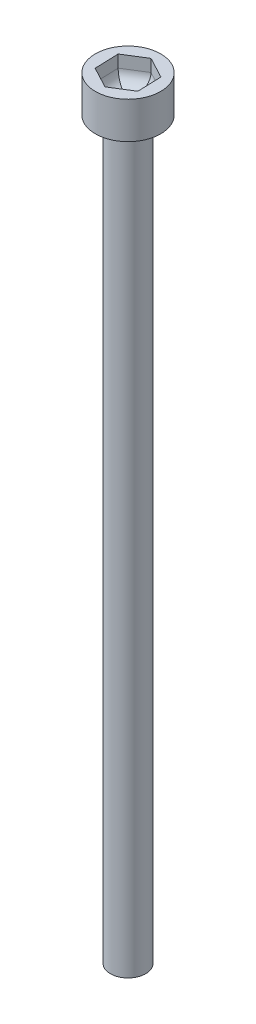
ISO-10303-21;
HEADER;
FILE_DESCRIPTION(('STEP AP214'),'2;1');
FILE_NAME('part.step','',(''),(''),'','','');
FILE_SCHEMA(('AUTOMOTIVE_DESIGN { 1 0 10303 214 1 1 1 1 }'));
ENDSEC;
DATA;
#1=APPLICATION_CONTEXT('core data for automotive mechanical design processes');
#2=APPLICATION_PROTOCOL_DEFINITION('international standard','automotive_design',2000,#1);
#3=PRODUCT_CONTEXT('',#1,'mechanical');
#4=PRODUCT('Part','Part','',(#3));
#5=PRODUCT_RELATED_PRODUCT_CATEGORY('part','',(#4));
#6=PRODUCT_DEFINITION_FORMATION('','',#4);
#7=PRODUCT_DEFINITION_CONTEXT('part definition',#1,'design');
#8=PRODUCT_DEFINITION('design','',#6,#7);
#9=PRODUCT_DEFINITION_SHAPE('','',#8);
#10=(LENGTH_UNIT() NAMED_UNIT(*) SI_UNIT(.MILLI.,.METRE.));
#11=(NAMED_UNIT(*) PLANE_ANGLE_UNIT() SI_UNIT($,.RADIAN.));
#12=(NAMED_UNIT(*) SI_UNIT($,.STERADIAN.) SOLID_ANGLE_UNIT());
#13=UNCERTAINTY_MEASURE_WITH_UNIT(LENGTH_MEASURE(1.E-05),#10,'distance_accuracy_value','');
#14=(GEOMETRIC_REPRESENTATION_CONTEXT(3) GLOBAL_UNCERTAINTY_ASSIGNED_CONTEXT((#13)) GLOBAL_UNIT_ASSIGNED_CONTEXT((#10,
#11,#12)) REPRESENTATION_CONTEXT('',''));
#15=CARTESIAN_POINT('',(0.,0.,0.));
#16=DIRECTION('',(0.,0.,1.));
#17=DIRECTION('',(1.,0.,0.));
#18=AXIS2_PLACEMENT_3D('',#15,#16,#17);
#19=CARTESIAN_POINT('',(0.,63.,0.));
#20=DIRECTION('',(0.,1.,0.));
#21=DIRECTION('',(0.,0.,1.));
#22=AXIS2_PLACEMENT_3D('',#19,#20,#21);
#23=PLANE('',#22);
#24=DIRECTION('',(0.848064790722021,0.,-0.529892546406925));
#25=VECTOR('',#24,1.);
#26=CARTESIAN_POINT('',(0.0679258909226605,63.,1.94690161003891));
#27=LINE('',#26,#25);
#28=CARTESIAN_POINT('',(0.0679258909226605,63.,1.94690161003891));
#29=VERTEX_POINT('',#28);
#30=CARTESIAN_POINT('',(1.72002919842385,63.,0.914625257905739));
#31=VERTEX_POINT('',#30);
#32=EDGE_CURVE('E125',#29,#31,#27,.T.);
#33=ORIENTED_EDGE('',*,*,#32,.F.);
#34=DIRECTION('',(0.882932801825432,0.,0.469499379616942));
#35=VECTOR('',#34,1.);
#36=CARTESIAN_POINT('',(-1.65210330750119,63.,1.03227635213317));
#37=LINE('',#36,#35);
#38=CARTESIAN_POINT('',(-1.65210330750119,63.,1.03227635213317));
#39=VERTEX_POINT('',#38);
#40=EDGE_CURVE('E138',#39,#29,#37,.T.);
#41=ORIENTED_EDGE('',*,*,#40,.F.);
#42=DIRECTION('',(0.0348680111034108,0.,0.999391926023866));
#43=VECTOR('',#42,1.);
#44=CARTESIAN_POINT('',(-1.72002919842385,63.,-0.91462525790574));
#45=LINE('',#44,#43);
#46=CARTESIAN_POINT('',(-1.72002919842385,63.,-0.91462525790574));
#47=VERTEX_POINT('',#46);
#48=EDGE_CURVE('E132',#47,#39,#45,.T.);
#49=ORIENTED_EDGE('',*,*,#48,.F.);
#50=DIRECTION('',(-0.848064790722021,0.,0.529892546406925));
#51=VECTOR('',#50,1.);
#52=CARTESIAN_POINT('',(-0.0679258909226607,63.,-1.94690161003891));
#53=LINE('',#52,#51);
#54=CARTESIAN_POINT('',(-0.0679258909226607,63.,-1.94690161003891));
#55=VERTEX_POINT('',#54);
#56=EDGE_CURVE('E130',#55,#47,#53,.T.);
#57=ORIENTED_EDGE('',*,*,#56,.F.);
#58=DIRECTION('',(-0.882932801825432,0.,-0.469499379616941));
#59=VECTOR('',#58,1.);
#60=CARTESIAN_POINT('',(1.65210330750119,63.,-1.03227635213317));
#61=LINE('',#60,#59);
#62=CARTESIAN_POINT('',(1.65210330750119,63.,-1.03227635213317));
#63=VERTEX_POINT('',#62);
#64=EDGE_CURVE('E111',#63,#55,#61,.T.);
#65=ORIENTED_EDGE('',*,*,#64,.F.);
#66=DIRECTION('',(-0.034868011103411,0.,-0.999391926023866));
#67=VECTOR('',#66,1.);
#68=CARTESIAN_POINT('',(1.72002919842385,63.,0.914625257905739));
#69=LINE('',#68,#67);
#70=EDGE_CURVE('E119',#31,#63,#69,.T.);
#71=ORIENTED_EDGE('',*,*,#70,.F.);
#72=EDGE_LOOP('',(#33,#41,#49,#57,#65,#71));
#73=FACE_BOUND('',#72,.T.);
#74=CARTESIAN_POINT('',(0.,63.,0.));
#75=DIRECTION('',(0.,-1.,0.));
#76=DIRECTION('',(0.,0.,-1.));
#77=AXIS2_PLACEMENT_3D('',#74,#75,#76);
#78=CIRCLE('',#77,2.665);
#79=CARTESIAN_POINT('',(0.,63.,-2.665));
#80=VERTEX_POINT('',#79);
#81=EDGE_CURVE('E158',#80,#80,#78,.T.);
#82=ORIENTED_EDGE('',*,*,#81,.F.);
#83=EDGE_LOOP('',(#82));
#84=FACE_BOUND('',#83,.T.);
#85=ADVANCED_FACE('F38',(#73,#84),#23,.T.);
#86=CARTESIAN_POINT('',(0.,0.,0.));
#87=DIRECTION('',(0.,-1.,0.));
#88=DIRECTION('',(0.,0.,-1.));
#89=AXIS2_PLACEMENT_3D('',#86,#87,#88);
#90=CYLINDRICAL_SURFACE('',#89,2.665);
#91=ORIENTED_EDGE('',*,*,#81,.T.);
#92=EDGE_LOOP('',(#91));
#93=FACE_BOUND('',#92,.T.);
#94=CARTESIAN_POINT('',(0.,60.,0.));
#95=DIRECTION('',(0.,-1.,0.));
#96=DIRECTION('',(0.,0.,-1.));
#97=AXIS2_PLACEMENT_3D('',#94,#95,#96);
#98=CIRCLE('',#97,2.665);
#99=CARTESIAN_POINT('',(0.,60.,-2.665));
#100=VERTEX_POINT('',#99);
#101=EDGE_CURVE('E155',#100,#100,#98,.T.);
#102=ORIENTED_EDGE('',*,*,#101,.F.);
#103=EDGE_LOOP('',(#102));
#104=FACE_BOUND('',#103,.T.);
#105=ADVANCED_FACE('F243',(#93,#104),#90,.T.);
#106=CARTESIAN_POINT('',(2.665,60.,0.));
#107=DIRECTION('',(0.,-1.,0.));
#108=DIRECTION('',(0.,0.,-1.));
#109=AXIS2_PLACEMENT_3D('',#106,#107,#108);
#110=PLANE('',#109);
#111=ORIENTED_EDGE('',*,*,#101,.T.);
#112=EDGE_LOOP('',(#111));
#113=FACE_BOUND('',#112,.T.);
#114=CARTESIAN_POINT('',(0.,60.,0.));
#115=DIRECTION('',(0.,-1.,0.));
#116=DIRECTION('',(0.,0.,-1.));
#117=AXIS2_PLACEMENT_3D('',#114,#115,#116);
#118=CIRCLE('',#117,1.44000000000001);
#119=CARTESIAN_POINT('',(0.,60.,-1.44000000000001));
#120=VERTEX_POINT('',#119);
#121=EDGE_CURVE('E152',#120,#120,#118,.T.);
#122=ORIENTED_EDGE('',*,*,#121,.F.);
#123=EDGE_LOOP('',(#122));
#124=FACE_BOUND('',#123,.T.);
#125=ADVANCED_FACE('F248',(#113,#124),#110,.T.);
#126=CARTESIAN_POINT('',(0.,0.,0.));
#127=DIRECTION('',(0.,-1.,0.));
#128=DIRECTION('',(0.,0.,-1.));
#129=AXIS2_PLACEMENT_3D('',#126,#127,#128);
#130=CYLINDRICAL_SURFACE('',#129,1.44);
#131=ORIENTED_EDGE('',*,*,#121,.T.);
#132=EDGE_LOOP('',(#131));
#133=FACE_BOUND('',#132,.T.);
#134=CARTESIAN_POINT('',(0.,0.,0.));
#135=DIRECTION('',(0.,-1.,0.));
#136=DIRECTION('',(0.,0.,-1.));
#137=AXIS2_PLACEMENT_3D('',#134,#135,#136);
#138=CIRCLE('',#137,1.43999999999999);
#139=CARTESIAN_POINT('',(0.,0.,-1.43999999999999));
#140=VERTEX_POINT('',#139);
#141=EDGE_CURVE('E143',#140,#140,#138,.T.);
#142=ORIENTED_EDGE('',*,*,#141,.F.);
#143=EDGE_LOOP('',(#142));
#144=FACE_BOUND('',#143,.T.);
#145=ADVANCED_FACE('F347',(#133,#144),#130,.T.);
#146=CARTESIAN_POINT('',(0.,0.,0.));
#147=DIRECTION('',(0.,-1.,0.));
#148=DIRECTION('',(0.,0.,-1.));
#149=AXIS2_PLACEMENT_3D('',#146,#147,#148);
#150=PLANE('',#149);
#151=ORIENTED_EDGE('',*,*,#141,.T.);
#152=EDGE_LOOP('',(#151));
#153=FACE_BOUND('',#152,.T.);
#154=ADVANCED_FACE('F339',(#153),#150,.T.);
#155=CARTESIAN_POINT('',(0.0679258909226605,61.,1.94690161003891));
#156=DIRECTION('',(0.529892546406925,0.,0.848064790722021));
#157=DIRECTION('',(0.848064790722021,0.,-0.529892546406925));
#158=AXIS2_PLACEMENT_3D('',#155,#156,#157);
#159=PLANE('',#158);
#160=DIRECTION('',(0.,1.,0.));
#161=VECTOR('',#160,1.);
#162=CARTESIAN_POINT('',(1.72002919842385,61.,0.914625257905739));
#163=LINE('',#162,#161);
#164=CARTESIAN_POINT('',(1.72002919842385,62.,0.914625257905739));
#165=VERTEX_POINT('',#164);
#166=EDGE_CURVE('E116',#165,#31,#163,.T.);
#167=ORIENTED_EDGE('',*,*,#166,.F.);
#168=DIRECTION('',(0.848064790722021,0.,-0.529892546406925));
#169=VECTOR('',#168,1.);
#170=CARTESIAN_POINT('',(0.0679258909226605,62.,1.94690161003891));
#171=LINE('',#170,#169);
#172=CARTESIAN_POINT('',(0.0679258909226605,62.,1.94690161003891));
#173=VERTEX_POINT('',#172);
#174=EDGE_CURVE('E174',#165,#173,#171,.F.);
#175=ORIENTED_EDGE('',*,*,#174,.T.);
#176=DIRECTION('',(0.,1.,0.));
#177=VECTOR('',#176,1.);
#178=CARTESIAN_POINT('',(0.0679258909226605,61.,1.94690161003891));
#179=LINE('',#178,#177);
#180=EDGE_CURVE('E141',#173,#29,#179,.T.);
#181=ORIENTED_EDGE('',*,*,#180,.T.);
#182=ORIENTED_EDGE('',*,*,#32,.T.);
#183=EDGE_LOOP('',(#167,#175,#181,#182));
#184=FACE_BOUND('',#183,.T.);
#185=ADVANCED_FACE('F204',(#184),#159,.F.);
#186=CARTESIAN_POINT('',(-1.65210330750119,61.,1.03227635213317));
#187=DIRECTION('',(-0.469499379616941,0.,0.882932801825432));
#188=DIRECTION('',(0.882932801825432,0.,0.469499379616942));
#189=AXIS2_PLACEMENT_3D('',#186,#187,#188);
#190=PLANE('',#189);
#191=ORIENTED_EDGE('',*,*,#180,.F.);
#192=DIRECTION('',(0.882932801825432,0.,0.469499379616942));
#193=VECTOR('',#192,1.);
#194=CARTESIAN_POINT('',(-1.65210330750119,62.,1.03227635213317));
#195=LINE('',#194,#193);
#196=CARTESIAN_POINT('',(-1.65210330750119,62.,1.03227635213317));
#197=VERTEX_POINT('',#196);
#198=EDGE_CURVE('E177',#173,#197,#195,.F.);
#199=ORIENTED_EDGE('',*,*,#198,.T.);
#200=DIRECTION('',(0.,1.,0.));
#201=VECTOR('',#200,1.);
#202=CARTESIAN_POINT('',(-1.65210330750119,61.,1.03227635213317));
#203=LINE('',#202,#201);
#204=EDGE_CURVE('E144',#197,#39,#203,.T.);
#205=ORIENTED_EDGE('',*,*,#204,.T.);
#206=ORIENTED_EDGE('',*,*,#40,.T.);
#207=EDGE_LOOP('',(#191,#199,#205,#206));
#208=FACE_BOUND('',#207,.T.);
#209=ADVANCED_FACE('F209',(#208),#190,.F.);
#210=CARTESIAN_POINT('',(-1.72002919842385,61.,-0.91462525790574));
#211=DIRECTION('',(-0.999391926023866,0.,0.0348680111034108));
#212=DIRECTION('',(0.0348680111034108,0.,0.999391926023866));
#213=AXIS2_PLACEMENT_3D('',#210,#211,#212);
#214=PLANE('',#213);
#215=ORIENTED_EDGE('',*,*,#204,.F.);
#216=DIRECTION('',(0.0348680111034108,0.,0.999391926023866));
#217=VECTOR('',#216,1.);
#218=CARTESIAN_POINT('',(-1.72002919842385,62.,-0.91462525790574));
#219=LINE('',#218,#217);
#220=CARTESIAN_POINT('',(-1.72002919842385,62.,-0.91462525790574));
#221=VERTEX_POINT('',#220);
#222=EDGE_CURVE('E179',#197,#221,#219,.F.);
#223=ORIENTED_EDGE('',*,*,#222,.T.);
#224=DIRECTION('',(0.,1.,0.));
#225=VECTOR('',#224,1.);
#226=CARTESIAN_POINT('',(-1.72002919842385,61.,-0.91462525790574));
#227=LINE('',#226,#225);
#228=EDGE_CURVE('E146',#221,#47,#227,.T.);
#229=ORIENTED_EDGE('',*,*,#228,.T.);
#230=ORIENTED_EDGE('',*,*,#48,.T.);
#231=EDGE_LOOP('',(#215,#223,#229,#230));
#232=FACE_BOUND('',#231,.T.);
#233=ADVANCED_FACE('F213',(#232),#214,.F.);
#234=CARTESIAN_POINT('',(-0.0679258909226607,61.,-1.94690161003891));
#235=DIRECTION('',(-0.529892546406925,0.,-0.848064790722021));
#236=DIRECTION('',(-0.848064790722021,0.,0.529892546406925));
#237=AXIS2_PLACEMENT_3D('',#234,#235,#236);
#238=PLANE('',#237);
#239=ORIENTED_EDGE('',*,*,#228,.F.);
#240=DIRECTION('',(-0.848064790722021,0.,0.529892546406925));
#241=VECTOR('',#240,1.);
#242=CARTESIAN_POINT('',(-0.0679258909226607,62.,-1.94690161003891));
#243=LINE('',#242,#241);
#244=CARTESIAN_POINT('',(-0.0679258909226607,62.,-1.94690161003891));
#245=VERTEX_POINT('',#244);
#246=EDGE_CURVE('E11',#221,#245,#243,.F.);
#247=ORIENTED_EDGE('',*,*,#246,.T.);
#248=DIRECTION('',(0.,1.,0.));
#249=VECTOR('',#248,1.);
#250=CARTESIAN_POINT('',(-0.0679258909226607,61.,-1.94690161003891));
#251=LINE('',#250,#249);
#252=EDGE_CURVE('E115',#245,#55,#251,.T.);
#253=ORIENTED_EDGE('',*,*,#252,.T.);
#254=ORIENTED_EDGE('',*,*,#56,.T.);
#255=EDGE_LOOP('',(#239,#247,#253,#254));
#256=FACE_BOUND('',#255,.T.);
#257=ADVANCED_FACE('F214',(#256),#238,.F.);
#258=CARTESIAN_POINT('',(1.65210330750119,61.,-1.03227635213317));
#259=DIRECTION('',(0.469499379616941,0.,-0.882932801825432));
#260=DIRECTION('',(-0.882932801825432,0.,-0.469499379616941));
#261=AXIS2_PLACEMENT_3D('',#258,#259,#260);
#262=PLANE('',#261);
#263=ORIENTED_EDGE('',*,*,#252,.F.);
#264=DIRECTION('',(-0.882932801825432,0.,-0.469499379616941));
#265=VECTOR('',#264,1.);
#266=CARTESIAN_POINT('',(1.65210330750119,62.,-1.03227635213317));
#267=LINE('',#266,#265);
#268=CARTESIAN_POINT('',(1.65210330750119,62.,-1.03227635213317));
#269=VERTEX_POINT('',#268);
#270=EDGE_CURVE('E47',#245,#269,#267,.F.);
#271=ORIENTED_EDGE('',*,*,#270,.T.);
#272=DIRECTION('',(0.,1.,0.));
#273=VECTOR('',#272,1.);
#274=CARTESIAN_POINT('',(1.65210330750119,61.,-1.03227635213317));
#275=LINE('',#274,#273);
#276=EDGE_CURVE('E107',#269,#63,#275,.T.);
#277=ORIENTED_EDGE('',*,*,#276,.T.);
#278=ORIENTED_EDGE('',*,*,#64,.T.);
#279=EDGE_LOOP('',(#263,#271,#277,#278));
#280=FACE_BOUND('',#279,.T.);
#281=ADVANCED_FACE('F109',(#280),#262,.F.);
#282=CARTESIAN_POINT('',(1.72002919842385,61.,0.914625257905739));
#283=DIRECTION('',(0.999391926023866,0.,-0.034868011103411));
#284=DIRECTION('',(-0.034868011103411,0.,-0.999391926023866));
#285=AXIS2_PLACEMENT_3D('',#282,#283,#284);
#286=PLANE('',#285);
#287=ORIENTED_EDGE('',*,*,#276,.F.);
#288=DIRECTION('',(-0.034868011103411,0.,-0.999391926023866));
#289=VECTOR('',#288,1.);
#290=CARTESIAN_POINT('',(1.72002919842385,62.,0.914625257905739));
#291=LINE('',#290,#289);
#292=EDGE_CURVE('E181',#269,#165,#291,.F.);
#293=ORIENTED_EDGE('',*,*,#292,.T.);
#294=ORIENTED_EDGE('',*,*,#166,.T.);
#295=ORIENTED_EDGE('',*,*,#70,.T.);
#296=EDGE_LOOP('',(#287,#293,#294,#295));
#297=FACE_BOUND('',#296,.T.);
#298=ADVANCED_FACE('F120',(#297),#286,.F.);
#299=CARTESIAN_POINT('',(0.,61.,0.));
#300=DIRECTION('',(0.,1.,0.));
#301=DIRECTION('',(0.,0.,1.));
#302=AXIS2_PLACEMENT_3D('',#299,#300,#301);
#303=PLANE('',#302);
#304=DIRECTION('',(0.882932801825432,0.,0.469499379616942));
#305=VECTOR('',#304,1.);
#306=CARTESIAN_POINT('',(-0.322589328672323,61.,0.606656179260608));
#307=LINE('',#306,#305);
#308=CARTESIAN_POINT('',(-0.672842437073985,61.,0.420409143513942));
#309=VERTEX_POINT('',#308);
#310=CARTESIAN_POINT('',(0.027663779729338,61.,0.792903215007274));
#311=VERTEX_POINT('',#310);
#312=EDGE_CURVE('E169',#309,#311,#307,.T.);
#313=ORIENTED_EDGE('',*,*,#312,.T.);
#314=DIRECTION('',(0.848064790722021,0.,-0.529892546406925));
#315=VECTOR('',#314,1.);
#316=CARTESIAN_POINT('',(0.364084998266331,61.,0.582698643250303));
#317=LINE('',#316,#315);
#318=CARTESIAN_POINT('',(0.700506216803324,61.,0.372494071493332));
#319=VERTEX_POINT('',#318);
#320=EDGE_CURVE('E171',#311,#319,#317,.T.);
#321=ORIENTED_EDGE('',*,*,#320,.T.);
#322=DIRECTION('',(-0.034868011103411,0.,-0.999391926023866));
#323=VECTOR('',#322,1.);
#324=CARTESIAN_POINT('',(0.686674326938654,61.,-0.0239575360103045));
#325=LINE('',#324,#323);
#326=CARTESIAN_POINT('',(0.672842437073985,61.,-0.420409143513942));
#327=VERTEX_POINT('',#326);
#328=EDGE_CURVE('E165',#319,#327,#325,.T.);
#329=ORIENTED_EDGE('',*,*,#328,.T.);
#330=DIRECTION('',(-0.882932801825432,0.,-0.469499379616941));
#331=VECTOR('',#330,1.);
#332=CARTESIAN_POINT('',(0.322589328672324,61.,-0.606656179260608));
#333=LINE('',#332,#331);
#334=CARTESIAN_POINT('',(-0.0276637797293384,61.,-0.792903215007275));
#335=VERTEX_POINT('',#334);
#336=EDGE_CURVE('E163',#327,#335,#333,.T.);
#337=ORIENTED_EDGE('',*,*,#336,.T.);
#338=DIRECTION('',(-0.848064790722021,0.,0.529892546406925));
#339=VECTOR('',#338,1.);
#340=CARTESIAN_POINT('',(-0.364084998266332,61.,-0.582698643250304));
#341=LINE('',#340,#339);
#342=CARTESIAN_POINT('',(-0.700506216803324,61.,-0.372494071493333));
#343=VERTEX_POINT('',#342);
#344=EDGE_CURVE('E161',#335,#343,#341,.T.);
#345=ORIENTED_EDGE('',*,*,#344,.T.);
#346=DIRECTION('',(0.0348680111034108,0.,0.999391926023866));
#347=VECTOR('',#346,1.);
#348=CARTESIAN_POINT('',(-0.686674326938654,61.,0.0239575360103043));
#349=LINE('',#348,#347);
#350=EDGE_CURVE('E167',#343,#309,#349,.T.);
#351=ORIENTED_EDGE('',*,*,#350,.T.);
#352=EDGE_LOOP('',(#313,#321,#329,#337,#345,#351));
#353=FACE_BOUND('',#352,.T.);
#354=ADVANCED_FACE('F233',(#353),#303,.T.);
#355=CARTESIAN_POINT('',(-0.364084998266331,62.,-0.582698643250304));
#356=DIRECTION('',(-0.848064790722021,0.,0.529892546406925));
#357=DIRECTION('',(0.529892546406925,0.,0.848064790722021));
#358=AXIS2_PLACEMENT_3D('',#355,#356,#357);
#359=CYLINDRICAL_SURFACE('',#358,1.);
#360=CARTESIAN_POINT('',(-0.0276637797293384,62.,-0.792903215007275));
#361=DIRECTION('',(-0.999391926023866,0.,0.0348680111034109));
#362=DIRECTION('',(-0.0348680111034109,0.,-0.999391926023866));
#363=AXIS2_PLACEMENT_3D('',#360,#361,#362);
#364=ELLIPSE('',#363,1.15470053837925,1.);
#365=EDGE_CURVE('E193',#245,#335,#364,.T.);
#366=ORIENTED_EDGE('',*,*,#365,.F.);
#367=ORIENTED_EDGE('',*,*,#246,.F.);
#368=CARTESIAN_POINT('',(-0.700506216803324,62.,-0.372494071493333));
#369=DIRECTION('',(-0.469499379616941,0.,0.882932801825432));
#370=DIRECTION('',(0.882932801825432,0.,0.469499379616941));
#371=AXIS2_PLACEMENT_3D('',#368,#369,#370);
#372=ELLIPSE('',#371,1.15470053837925,1.);
#373=EDGE_CURVE('E42',#343,#221,#372,.F.);
#374=ORIENTED_EDGE('',*,*,#373,.F.);
#375=ORIENTED_EDGE('',*,*,#344,.F.);
#376=EDGE_LOOP('',(#366,#367,#374,#375));
#377=FACE_BOUND('',#376,.T.);
#378=ADVANCED_FACE('F40',(#377),#359,.F.);
#379=CARTESIAN_POINT('',(-0.686674326938654,62.,0.0239575360103043));
#380=DIRECTION('',(0.0348680111034108,0.,0.999391926023866));
#381=DIRECTION('',(0.999391926023866,0.,-0.0348680111034108));
#382=AXIS2_PLACEMENT_3D('',#379,#380,#381);
#383=CYLINDRICAL_SURFACE('',#382,1.);
#384=ORIENTED_EDGE('',*,*,#373,.T.);
#385=ORIENTED_EDGE('',*,*,#222,.F.);
#386=CARTESIAN_POINT('',(-0.672842437073985,62.,0.420409143513942));
#387=DIRECTION('',(0.529892546406925,0.,0.848064790722021));
#388=DIRECTION('',(0.848064790722021,0.,-0.529892546406925));
#389=AXIS2_PLACEMENT_3D('',#386,#387,#388);
#390=ELLIPSE('',#389,1.15470053837925,1.);
#391=EDGE_CURVE('E191',#309,#197,#390,.F.);
#392=ORIENTED_EDGE('',*,*,#391,.F.);
#393=ORIENTED_EDGE('',*,*,#350,.F.);
#394=EDGE_LOOP('',(#384,#385,#392,#393));
#395=FACE_BOUND('',#394,.T.);
#396=ADVANCED_FACE('F231',(#395),#383,.F.);
#397=CARTESIAN_POINT('',(0.322589328672323,62.,-0.606656179260608));
#398=DIRECTION('',(-0.882932801825432,0.,-0.469499379616941));
#399=DIRECTION('',(-0.469499379616941,0.,0.882932801825432));
#400=AXIS2_PLACEMENT_3D('',#397,#398,#399);
#401=CYLINDRICAL_SURFACE('',#400,1.);
#402=ORIENTED_EDGE('',*,*,#365,.T.);
#403=ORIENTED_EDGE('',*,*,#336,.F.);
#404=CARTESIAN_POINT('',(0.672842437073985,62.,-0.420409143513942));
#405=DIRECTION('',(-0.529892546406925,0.,-0.848064790722021));
#406=DIRECTION('',(0.848064790722021,0.,-0.529892546406925));
#407=AXIS2_PLACEMENT_3D('',#404,#405,#406);
#408=ELLIPSE('',#407,1.15470053837925,1.);
#409=EDGE_CURVE('E188',#269,#327,#408,.T.);
#410=ORIENTED_EDGE('',*,*,#409,.F.);
#411=ORIENTED_EDGE('',*,*,#270,.F.);
#412=EDGE_LOOP('',(#402,#403,#410,#411));
#413=FACE_BOUND('',#412,.T.);
#414=ADVANCED_FACE('F217',(#413),#401,.F.);
#415=CARTESIAN_POINT('',(-0.322589328672323,62.,0.606656179260608));
#416=DIRECTION('',(0.882932801825432,0.,0.469499379616942));
#417=DIRECTION('',(0.469499379616942,0.,-0.882932801825432));
#418=AXIS2_PLACEMENT_3D('',#415,#416,#417);
#419=CYLINDRICAL_SURFACE('',#418,1.);
#420=ORIENTED_EDGE('',*,*,#391,.T.);
#421=ORIENTED_EDGE('',*,*,#198,.F.);
#422=CARTESIAN_POINT('',(0.0276637797293382,62.,0.792903215007274));
#423=DIRECTION('',(0.999391926023866,0.,-0.0348680111034109));
#424=DIRECTION('',(-0.0348680111034108,0.,-0.999391926023866));
#425=AXIS2_PLACEMENT_3D('',#422,#423,#424);
#426=ELLIPSE('',#425,1.15470053837925,1.);
#427=EDGE_CURVE('E186',#311,#173,#426,.F.);
#428=ORIENTED_EDGE('',*,*,#427,.F.);
#429=ORIENTED_EDGE('',*,*,#312,.F.);
#430=EDGE_LOOP('',(#420,#421,#428,#429));
#431=FACE_BOUND('',#430,.T.);
#432=ADVANCED_FACE('F229',(#431),#419,.F.);
#433=CARTESIAN_POINT('',(0.686674326938654,62.,-0.0239575360103045));
#434=DIRECTION('',(-0.034868011103411,0.,-0.999391926023866));
#435=DIRECTION('',(-0.999391926023866,0.,0.034868011103411));
#436=AXIS2_PLACEMENT_3D('',#433,#434,#435);
#437=CYLINDRICAL_SURFACE('',#436,1.);
#438=ORIENTED_EDGE('',*,*,#409,.T.);
#439=ORIENTED_EDGE('',*,*,#328,.F.);
#440=CARTESIAN_POINT('',(0.700506216803324,62.,0.372494071493332));
#441=DIRECTION('',(0.469499379616941,0.,-0.882932801825432));
#442=DIRECTION('',(0.882932801825432,0.,0.469499379616941));
#443=AXIS2_PLACEMENT_3D('',#440,#441,#442);
#444=ELLIPSE('',#443,1.15470053837925,1.);
#445=EDGE_CURVE('E184',#165,#319,#444,.T.);
#446=ORIENTED_EDGE('',*,*,#445,.F.);
#447=ORIENTED_EDGE('',*,*,#292,.F.);
#448=EDGE_LOOP('',(#438,#439,#446,#447));
#449=FACE_BOUND('',#448,.T.);
#450=ADVANCED_FACE('F222',(#449),#437,.F.);
#451=CARTESIAN_POINT('',(0.364084998266331,62.,0.582698643250303));
#452=DIRECTION('',(0.848064790722021,0.,-0.529892546406925));
#453=DIRECTION('',(-0.529892546406925,0.,-0.848064790722021));
#454=AXIS2_PLACEMENT_3D('',#451,#452,#453);
#455=CYLINDRICAL_SURFACE('',#454,1.);
#456=ORIENTED_EDGE('',*,*,#427,.T.);
#457=ORIENTED_EDGE('',*,*,#174,.F.);
#458=ORIENTED_EDGE('',*,*,#445,.T.);
#459=ORIENTED_EDGE('',*,*,#320,.F.);
#460=EDGE_LOOP('',(#456,#457,#458,#459));
#461=FACE_BOUND('',#460,.T.);
#462=ADVANCED_FACE('F225',(#461),#455,.F.);
#463=CLOSED_SHELL('',(#85,#105,#125,#145,#154,#185,#209,#233,#257,#281,#298,#354,#378,#396,#414,
#432,#450,#462));
#464=MANIFOLD_SOLID_BREP('B2',#463);
#465=ADVANCED_BREP_SHAPE_REPRESENTATION('',(#18,#464),#14);
#466=SHAPE_DEFINITION_REPRESENTATION(#9,#465);
ENDSEC;
END-ISO-10303-21;
